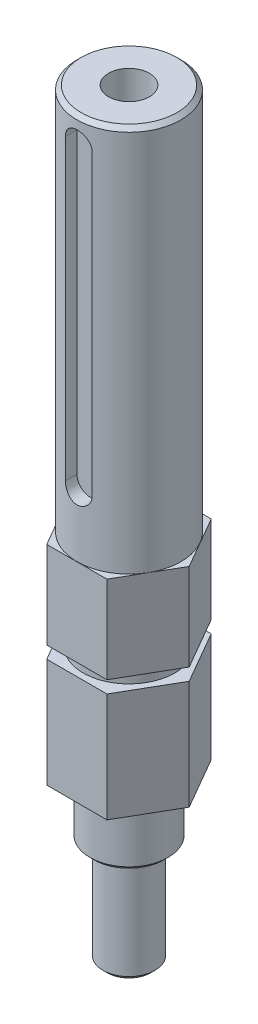
ISO-10303-21;
HEADER;
FILE_DESCRIPTION(('STEP AP214'),'2;1');
FILE_NAME('part.step','',(''),(''),'','','');
FILE_SCHEMA(('AUTOMOTIVE_DESIGN { 1 0 10303 214 1 1 1 1 }'));
ENDSEC;
DATA;
#1=APPLICATION_CONTEXT('core data for automotive mechanical design processes');
#2=APPLICATION_PROTOCOL_DEFINITION('international standard','automotive_design',2000,#1);
#3=PRODUCT_CONTEXT('',#1,'mechanical');
#4=PRODUCT('Part','Part','',(#3));
#5=PRODUCT_RELATED_PRODUCT_CATEGORY('part','',(#4));
#6=PRODUCT_DEFINITION_FORMATION('','',#4);
#7=PRODUCT_DEFINITION_CONTEXT('part definition',#1,'design');
#8=PRODUCT_DEFINITION('design','',#6,#7);
#9=PRODUCT_DEFINITION_SHAPE('','',#8);
#10=(LENGTH_UNIT() NAMED_UNIT(*) SI_UNIT(.MILLI.,.METRE.));
#11=(NAMED_UNIT(*) PLANE_ANGLE_UNIT() SI_UNIT($,.RADIAN.));
#12=(NAMED_UNIT(*) SI_UNIT($,.STERADIAN.) SOLID_ANGLE_UNIT());
#13=UNCERTAINTY_MEASURE_WITH_UNIT(LENGTH_MEASURE(1.E-05),#10,'distance_accuracy_value','');
#14=(GEOMETRIC_REPRESENTATION_CONTEXT(3) GLOBAL_UNCERTAINTY_ASSIGNED_CONTEXT((#13)) GLOBAL_UNIT_ASSIGNED_CONTEXT((#10,
#11,#12)) REPRESENTATION_CONTEXT('',''));
#15=CARTESIAN_POINT('',(0.,0.,0.));
#16=DIRECTION('',(0.,0.,1.));
#17=DIRECTION('',(1.,0.,0.));
#18=AXIS2_PLACEMENT_3D('',#15,#16,#17);
#19=CARTESIAN_POINT('',(-35.1448337161431,-45.212,-16.669011646302));
#20=DIRECTION('',(0.,-1.,0.));
#21=DIRECTION('',(0.,0.,-1.));
#22=AXIS2_PLACEMENT_3D('',#19,#20,#21);
#23=PLANE('',#22);
#24=CARTESIAN_POINT('',(-38.3071337161431,-45.2119999999923,-16.669011646302));
#25=DIRECTION('',(0.,1.,0.));
#26=DIRECTION('',(0.,0.,1.));
#27=AXIS2_PLACEMENT_3D('',#24,#25,#26);
#28=CIRCLE('',#27,2.65430000003345);
#29=CARTESIAN_POINT('',(-38.3071337161431,-45.2119999999923,-14.0147116462686));
#30=VERTEX_POINT('',#29);
#31=EDGE_CURVE('E20',#30,#30,#28,.T.);
#32=ORIENTED_EDGE('',*,*,#31,.F.);
#33=EDGE_LOOP('',(#32));
#34=FACE_BOUND('',#33,.T.);
#35=ADVANCED_FACE('F17',(#34),#23,.T.);
#36=CARTESIAN_POINT('',(-38.3071337161431,-44.704000000138,-16.669011646302));
#37=DIRECTION('',(0.,1.,0.));
#38=DIRECTION('',(0.,0.,1.));
#39=AXIS2_PLACEMENT_3D('',#36,#37,#38);
#40=CONICAL_SURFACE('',#39,3.16229999994458,0.785398163453397);
#41=ORIENTED_EDGE('',*,*,#31,.T.);
#42=EDGE_LOOP('',(#41));
#43=FACE_BOUND('',#42,.T.);
#44=CARTESIAN_POINT('',(-38.3071337161431,-44.704,-16.669011646302));
#45=DIRECTION('',(0.,1.,0.));
#46=DIRECTION('',(0.,0.,1.));
#47=AXIS2_PLACEMENT_3D('',#44,#45,#46);
#48=CIRCLE('',#47,3.1623);
#49=CARTESIAN_POINT('',(-38.3071337161431,-44.704,-13.506711646302));
#50=VERTEX_POINT('',#49);
#51=EDGE_CURVE('E176',#50,#50,#48,.T.);
#52=ORIENTED_EDGE('',*,*,#51,.F.);
#53=EDGE_LOOP('',(#52));
#54=FACE_BOUND('',#53,.T.);
#55=ADVANCED_FACE('F374',(#43,#54),#40,.T.);
#56=CARTESIAN_POINT('',(-38.3071337161431,-45.212,-16.669011646302));
#57=DIRECTION('',(0.,1.,0.));
#58=DIRECTION('',(0.,0.,1.));
#59=AXIS2_PLACEMENT_3D('',#56,#57,#58);
#60=CYLINDRICAL_SURFACE('',#59,3.1623);
#61=ORIENTED_EDGE('',*,*,#51,.T.);
#62=EDGE_LOOP('',(#61));
#63=FACE_BOUND('',#62,.T.);
#64=CARTESIAN_POINT('',(-38.3071337161431,-32.512,-16.669011646302));
#65=DIRECTION('',(0.,1.,0.));
#66=DIRECTION('',(0.,0.,1.));
#67=AXIS2_PLACEMENT_3D('',#64,#65,#66);
#68=CIRCLE('',#67,3.1623);
#69=CARTESIAN_POINT('',(-38.3071337161431,-32.512,-13.506711646302));
#70=VERTEX_POINT('',#69);
#71=EDGE_CURVE('E178',#70,#70,#68,.T.);
#72=ORIENTED_EDGE('',*,*,#71,.F.);
#73=EDGE_LOOP('',(#72));
#74=FACE_BOUND('',#73,.T.);
#75=ADVANCED_FACE('F371',(#63,#74),#60,.T.);
#76=CARTESIAN_POINT('',(-33.5573337161431,-32.512,-16.669011646302));
#77=DIRECTION('',(0.,-1.,0.));
#78=DIRECTION('',(0.,0.,-1.));
#79=AXIS2_PLACEMENT_3D('',#76,#77,#78);
#80=PLANE('',#79);
#81=ORIENTED_EDGE('',*,*,#71,.T.);
#82=EDGE_LOOP('',(#81));
#83=FACE_BOUND('',#82,.T.);
#84=CARTESIAN_POINT('',(-38.3071337161431,-32.5119999999401,-16.669011646302));
#85=DIRECTION('',(0.,1.,0.));
#86=DIRECTION('',(0.,0.,1.));
#87=AXIS2_PLACEMENT_3D('',#84,#85,#86);
#88=CIRCLE('',#87,4.24180000006128);
#89=CARTESIAN_POINT('',(-38.3071337161431,-32.5119999999401,-12.4272116462407));
#90=VERTEX_POINT('',#89);
#91=EDGE_CURVE('E175',#90,#90,#88,.T.);
#92=ORIENTED_EDGE('',*,*,#91,.F.);
#93=EDGE_LOOP('',(#92));
#94=FACE_BOUND('',#93,.T.);
#95=ADVANCED_FACE('F367',(#83,#94),#80,.T.);
#96=CARTESIAN_POINT('',(-38.3071337161431,-32.0040000000859,-16.669011646302));
#97=DIRECTION('',(0.,1.,0.));
#98=DIRECTION('',(0.,0.,1.));
#99=AXIS2_PLACEMENT_3D('',#96,#97,#98);
#100=CONICAL_SURFACE('',#99,4.74979999991557,0.785398163397448);
#101=CARTESIAN_POINT('',(-38.3071337161431,-32.004,-16.669011646302));
#102=DIRECTION('',(0.,1.,0.));
#103=DIRECTION('',(0.,0.,1.));
#104=AXIS2_PLACEMENT_3D('',#101,#102,#103);
#105=CIRCLE('',#104,4.7498);
#106=CARTESIAN_POINT('',(-38.3071337161431,-32.004,-11.919211646302));
#107=VERTEX_POINT('',#106);
#108=EDGE_CURVE('E172',#107,#107,#105,.T.);
#109=ORIENTED_EDGE('',*,*,#108,.F.);
#110=EDGE_LOOP('',(#109));
#111=FACE_BOUND('',#110,.T.);
#112=ORIENTED_EDGE('',*,*,#91,.T.);
#113=EDGE_LOOP('',(#112));
#114=FACE_BOUND('',#113,.T.);
#115=ADVANCED_FACE('F363',(#111,#114),#100,.T.);
#116=CARTESIAN_POINT('',(-38.3071337161431,-45.212,-16.669011646302));
#117=DIRECTION('',(0.,1.,0.));
#118=DIRECTION('',(0.,0.,1.));
#119=AXIS2_PLACEMENT_3D('',#116,#117,#118);
#120=CYLINDRICAL_SURFACE('',#119,4.7498);
#121=CARTESIAN_POINT('',(-38.3071337161431,-25.4,-16.669011646302));
#122=DIRECTION('',(0.,1.,0.));
#123=DIRECTION('',(0.,0.,1.));
#124=AXIS2_PLACEMENT_3D('',#121,#122,#123);
#125=CIRCLE('',#124,4.7498);
#126=CARTESIAN_POINT('',(-38.3071337161431,-25.4,-11.919211646302));
#127=VERTEX_POINT('',#126);
#128=EDGE_CURVE('E154',#127,#127,#125,.T.);
#129=ORIENTED_EDGE('',*,*,#128,.F.);
#130=EDGE_LOOP('',(#129));
#131=FACE_BOUND('',#130,.T.);
#132=ORIENTED_EDGE('',*,*,#108,.T.);
#133=EDGE_LOOP('',(#132));
#134=FACE_BOUND('',#133,.T.);
#135=ADVANCED_FACE('F360',(#131,#134),#120,.T.);
#136=CARTESIAN_POINT('',(-41.9733079254973,-25.4,-10.319011646302));
#137=DIRECTION('',(0.,-1.,0.));
#138=DIRECTION('',(0.,0.,-1.));
#139=AXIS2_PLACEMENT_3D('',#136,#137,#138);
#140=PLANE('',#139);
#141=DIRECTION('',(-0.5,0.,-0.866025403784439));
#142=VECTOR('',#141,1.);
#143=CARTESIAN_POINT('',(-34.640959506789,-25.4,-23.019011646302));
#144=LINE('',#143,#142);
#145=CARTESIAN_POINT('',(-30.9747852974349,-25.4,-16.669011646302));
#146=VERTEX_POINT('',#145);
#147=CARTESIAN_POINT('',(-34.640959506789,-25.4,-23.019011646302));
#148=VERTEX_POINT('',#147);
#149=EDGE_CURVE('E313',#146,#148,#144,.T.);
#150=ORIENTED_EDGE('',*,*,#149,.F.);
#151=DIRECTION('',(0.500000000000001,0.,-0.866025403784438));
#152=VECTOR('',#151,1.);
#153=CARTESIAN_POINT('',(-30.9747852974349,-25.4,-16.669011646302));
#154=LINE('',#153,#152);
#155=CARTESIAN_POINT('',(-34.640959506789,-25.4,-10.319011646302));
#156=VERTEX_POINT('',#155);
#157=EDGE_CURVE('E307',#156,#146,#154,.T.);
#158=ORIENTED_EDGE('',*,*,#157,.F.);
#159=DIRECTION('',(1.,0.,0.));
#160=VECTOR('',#159,1.);
#161=CARTESIAN_POINT('',(-34.640959506789,-25.4,-10.319011646302));
#162=LINE('',#161,#160);
#163=CARTESIAN_POINT('',(-41.9733079254973,-25.4,-10.319011646302));
#164=VERTEX_POINT('',#163);
#165=EDGE_CURVE('E151',#164,#156,#162,.T.);
#166=ORIENTED_EDGE('',*,*,#165,.F.);
#167=DIRECTION('',(0.5,0.,0.866025403784439));
#168=VECTOR('',#167,1.);
#169=CARTESIAN_POINT('',(-41.9733079254973,-25.4,-10.319011646302));
#170=LINE('',#169,#168);
#171=CARTESIAN_POINT('',(-45.6394821348514,-25.4,-16.669011646302));
#172=VERTEX_POINT('',#171);
#173=EDGE_CURVE('E146',#172,#164,#170,.T.);
#174=ORIENTED_EDGE('',*,*,#173,.F.);
#175=DIRECTION('',(-0.5,0.,0.866025403784439));
#176=VECTOR('',#175,1.);
#177=CARTESIAN_POINT('',(-45.6394821348514,-25.4,-16.669011646302));
#178=LINE('',#177,#176);
#179=CARTESIAN_POINT('',(-41.9733079254973,-25.4,-23.019011646302));
#180=VERTEX_POINT('',#179);
#181=EDGE_CURVE('E143',#180,#172,#178,.T.);
#182=ORIENTED_EDGE('',*,*,#181,.F.);
#183=DIRECTION('',(-1.,0.,0.));
#184=VECTOR('',#183,1.);
#185=CARTESIAN_POINT('',(-41.9733079254973,-25.4,-23.019011646302));
#186=LINE('',#185,#184);
#187=EDGE_CURVE('E163',#148,#180,#186,.T.);
#188=ORIENTED_EDGE('',*,*,#187,.F.);
#189=EDGE_LOOP('',(#150,#158,#166,#174,#182,#188));
#190=FACE_BOUND('',#189,.T.);
#191=ORIENTED_EDGE('',*,*,#128,.T.);
#192=EDGE_LOOP('',(#191));
#193=FACE_BOUND('',#192,.T.);
#194=ADVANCED_FACE('F148',(#190,#193),#140,.T.);
#195=CARTESIAN_POINT('',(-41.9733079254973,-12.1158,-10.319011646302));
#196=DIRECTION('',(-0.866025403784439,0.,0.5));
#197=DIRECTION('',(0.5,0.,0.866025403784439));
#198=AXIS2_PLACEMENT_3D('',#195,#196,#197);
#199=PLANE('',#198);
#200=DIRECTION('',(-0.5,0.,-0.866025403784438));
#201=VECTOR('',#200,1.);
#202=CARTESIAN_POINT('',(-41.9733079254973,-12.1158,-10.319011646302));
#203=LINE('',#202,#201);
#204=CARTESIAN_POINT('',(-41.9733079254973,-12.1158,-10.319011646302));
#205=VERTEX_POINT('',#204);
#206=CARTESIAN_POINT('',(-45.6394821348514,-12.1158,-16.669011646302));
#207=VERTEX_POINT('',#206);
#208=EDGE_CURVE('E160',#205,#207,#203,.T.);
#209=ORIENTED_EDGE('',*,*,#208,.T.);
#210=DIRECTION('',(0.,1.,0.));
#211=VECTOR('',#210,1.);
#212=CARTESIAN_POINT('',(-45.6394821348514,-12.1158,-16.669011646302));
#213=LINE('',#212,#211);
#214=EDGE_CURVE('E157',#172,#207,#213,.T.);
#215=ORIENTED_EDGE('',*,*,#214,.F.);
#216=ORIENTED_EDGE('',*,*,#173,.T.);
#217=DIRECTION('',(0.,1.,0.));
#218=VECTOR('',#217,1.);
#219=CARTESIAN_POINT('',(-41.9733079254973,-12.1158,-10.319011646302));
#220=LINE('',#219,#218);
#221=EDGE_CURVE('E298',#205,#164,#220,.F.);
#222=ORIENTED_EDGE('',*,*,#221,.F.);
#223=EDGE_LOOP('',(#209,#215,#216,#222));
#224=FACE_BOUND('',#223,.T.);
#225=ADVANCED_FACE('F158',(#224),#199,.T.);
#226=CARTESIAN_POINT('',(-45.6394821348514,-12.1158,-16.669011646302));
#227=DIRECTION('',(-0.866025403784439,0.,-0.5));
#228=DIRECTION('',(-0.5,0.,0.866025403784439));
#229=AXIS2_PLACEMENT_3D('',#226,#227,#228);
#230=PLANE('',#229);
#231=DIRECTION('',(0.5,0.,-0.866025403784438));
#232=VECTOR('',#231,1.);
#233=CARTESIAN_POINT('',(-45.6394821348514,-12.1158,-16.669011646302));
#234=LINE('',#233,#232);
#235=CARTESIAN_POINT('',(-41.9733079254973,-12.1158,-23.019011646302));
#236=VERTEX_POINT('',#235);
#237=EDGE_CURVE('E295',#207,#236,#234,.T.);
#238=ORIENTED_EDGE('',*,*,#237,.T.);
#239=DIRECTION('',(0.,1.,0.));
#240=VECTOR('',#239,1.);
#241=CARTESIAN_POINT('',(-41.9733079254973,-12.1158,-23.019011646302));
#242=LINE('',#241,#240);
#243=EDGE_CURVE('E167',#180,#236,#242,.T.);
#244=ORIENTED_EDGE('',*,*,#243,.F.);
#245=ORIENTED_EDGE('',*,*,#181,.T.);
#246=ORIENTED_EDGE('',*,*,#214,.T.);
#247=EDGE_LOOP('',(#238,#244,#245,#246));
#248=FACE_BOUND('',#247,.T.);
#249=ADVANCED_FACE('F165',(#248),#230,.T.);
#250=CARTESIAN_POINT('',(-41.9733079254973,-12.1158,-23.019011646302));
#251=DIRECTION('',(0.,0.,-1.));
#252=DIRECTION('',(-1.,0.,0.));
#253=AXIS2_PLACEMENT_3D('',#250,#251,#252);
#254=PLANE('',#253);
#255=DIRECTION('',(1.,0.,0.));
#256=VECTOR('',#255,1.);
#257=CARTESIAN_POINT('',(-41.9733079254973,-12.1158,-23.019011646302));
#258=LINE('',#257,#256);
#259=CARTESIAN_POINT('',(-34.640959506789,-12.1158,-23.019011646302));
#260=VERTEX_POINT('',#259);
#261=EDGE_CURVE('E293',#236,#260,#258,.T.);
#262=ORIENTED_EDGE('',*,*,#261,.T.);
#263=DIRECTION('',(0.,1.,0.));
#264=VECTOR('',#263,1.);
#265=CARTESIAN_POINT('',(-34.640959506789,-12.1158,-23.019011646302));
#266=LINE('',#265,#264);
#267=EDGE_CURVE('E310',#148,#260,#266,.T.);
#268=ORIENTED_EDGE('',*,*,#267,.F.);
#269=ORIENTED_EDGE('',*,*,#187,.T.);
#270=ORIENTED_EDGE('',*,*,#243,.T.);
#271=EDGE_LOOP('',(#262,#268,#269,#270));
#272=FACE_BOUND('',#271,.T.);
#273=ADVANCED_FACE('F318',(#272),#254,.T.);
#274=CARTESIAN_POINT('',(-34.640959506789,-12.1158,-23.019011646302));
#275=DIRECTION('',(0.866025403784439,0.,-0.5));
#276=DIRECTION('',(-0.5,0.,-0.866025403784439));
#277=AXIS2_PLACEMENT_3D('',#274,#275,#276);
#278=PLANE('',#277);
#279=DIRECTION('',(0.5,0.,0.866025403784438));
#280=VECTOR('',#279,1.);
#281=CARTESIAN_POINT('',(-34.640959506789,-12.1158,-23.019011646302));
#282=LINE('',#281,#280);
#283=CARTESIAN_POINT('',(-30.9747852974349,-12.1158,-16.669011646302));
#284=VERTEX_POINT('',#283);
#285=EDGE_CURVE('E291',#260,#284,#282,.T.);
#286=ORIENTED_EDGE('',*,*,#285,.T.);
#287=DIRECTION('',(0.,1.,0.));
#288=VECTOR('',#287,1.);
#289=CARTESIAN_POINT('',(-30.9747852974349,-12.1158,-16.669011646302));
#290=LINE('',#289,#288);
#291=EDGE_CURVE('E304',#146,#284,#290,.T.);
#292=ORIENTED_EDGE('',*,*,#291,.F.);
#293=ORIENTED_EDGE('',*,*,#149,.T.);
#294=ORIENTED_EDGE('',*,*,#267,.T.);
#295=EDGE_LOOP('',(#286,#292,#293,#294));
#296=FACE_BOUND('',#295,.T.);
#297=ADVANCED_FACE('F323',(#296),#278,.T.);
#298=CARTESIAN_POINT('',(-30.9747852974349,-12.1158,-16.669011646302));
#299=DIRECTION('',(0.866025403784438,0.,0.500000000000001));
#300=DIRECTION('',(0.500000000000001,0.,-0.866025403784438));
#301=AXIS2_PLACEMENT_3D('',#298,#299,#300);
#302=PLANE('',#301);
#303=DIRECTION('',(-0.500000000000001,0.,0.866025403784438));
#304=VECTOR('',#303,1.);
#305=CARTESIAN_POINT('',(-30.9747852974349,-12.1158,-16.669011646302));
#306=LINE('',#305,#304);
#307=CARTESIAN_POINT('',(-34.640959506789,-12.1158,-10.319011646302));
#308=VERTEX_POINT('',#307);
#309=EDGE_CURVE('E289',#284,#308,#306,.T.);
#310=ORIENTED_EDGE('',*,*,#309,.T.);
#311=DIRECTION('',(0.,1.,0.));
#312=VECTOR('',#311,1.);
#313=CARTESIAN_POINT('',(-34.640959506789,-12.1158,-10.319011646302));
#314=LINE('',#313,#312);
#315=EDGE_CURVE('E300',#156,#308,#314,.T.);
#316=ORIENTED_EDGE('',*,*,#315,.F.);
#317=ORIENTED_EDGE('',*,*,#157,.T.);
#318=ORIENTED_EDGE('',*,*,#291,.T.);
#319=EDGE_LOOP('',(#310,#316,#317,#318));
#320=FACE_BOUND('',#319,.T.);
#321=ADVANCED_FACE('F327',(#320),#302,.T.);
#322=CARTESIAN_POINT('',(-34.640959506789,-12.1158,-10.319011646302));
#323=DIRECTION('',(0.,0.,1.));
#324=DIRECTION('',(1.,0.,0.));
#325=AXIS2_PLACEMENT_3D('',#322,#323,#324);
#326=PLANE('',#325);
#327=DIRECTION('',(1.,0.,0.));
#328=VECTOR('',#327,1.);
#329=CARTESIAN_POINT('',(-41.9733079254973,-12.1158,-10.319011646302));
#330=LINE('',#329,#328);
#331=EDGE_CURVE('E286',#308,#205,#330,.F.);
#332=ORIENTED_EDGE('',*,*,#331,.T.);
#333=ORIENTED_EDGE('',*,*,#221,.T.);
#334=ORIENTED_EDGE('',*,*,#165,.T.);
#335=ORIENTED_EDGE('',*,*,#315,.T.);
#336=EDGE_LOOP('',(#332,#333,#334,#335));
#337=FACE_BOUND('',#336,.T.);
#338=ADVANCED_FACE('F330',(#337),#326,.T.);
#339=CARTESIAN_POINT('',(-41.9733079254973,-12.1158,-10.319011646302));
#340=DIRECTION('',(0.,-1.,0.));
#341=DIRECTION('',(0.,0.,-1.));
#342=AXIS2_PLACEMENT_3D('',#339,#340,#341);
#343=PLANE('',#342);
#344=CARTESIAN_POINT('',(-38.3071337161431,-12.1158,-16.669011646302));
#345=DIRECTION('',(0.,-1.,0.));
#346=DIRECTION('',(0.,0.,-1.));
#347=AXIS2_PLACEMENT_3D('',#344,#345,#346);
#348=CIRCLE('',#347,5.58800000000003);
#349=CARTESIAN_POINT('',(-38.3071337161431,-12.1158,-22.257011646302));
#350=VERTEX_POINT('',#349);
#351=EDGE_CURVE('E285',#350,#350,#348,.F.);
#352=ORIENTED_EDGE('',*,*,#351,.F.);
#353=EDGE_LOOP('',(#352));
#354=FACE_BOUND('',#353,.T.);
#355=ORIENTED_EDGE('',*,*,#309,.F.);
#356=ORIENTED_EDGE('',*,*,#285,.F.);
#357=ORIENTED_EDGE('',*,*,#261,.F.);
#358=ORIENTED_EDGE('',*,*,#237,.F.);
#359=ORIENTED_EDGE('',*,*,#208,.F.);
#360=ORIENTED_EDGE('',*,*,#331,.F.);
#361=EDGE_LOOP('',(#355,#356,#357,#358,#359,#360));
#362=FACE_BOUND('',#361,.T.);
#363=ADVANCED_FACE('F332',(#354,#362),#343,.F.);
#364=CARTESIAN_POINT('',(-38.3071337161431,31.2419999999999,-16.669011646302));
#365=DIRECTION('',(0.,1.,0.));
#366=DIRECTION('',(0.,0.,1.));
#367=AXIS2_PLACEMENT_3D('',#364,#365,#366);
#368=CONICAL_SURFACE('',#367,2.48793000000006,1.0297442586766);
#369=CARTESIAN_POINT('',(-38.3071337161431,29.7471008401027,-16.6690116463016));
#370=VERTEX_POINT('',#369);
#371=VERTEX_LOOP('',#370);
#372=FACE_BOUND('',#371,.T.);
#373=CARTESIAN_POINT('',(-38.3071337161431,31.242,-16.669011646302));
#374=DIRECTION('',(0.,-1.,0.));
#375=DIRECTION('',(0.,0.,-1.));
#376=AXIS2_PLACEMENT_3D('',#373,#374,#375);
#377=CIRCLE('',#376,2.48793);
#378=CARTESIAN_POINT('',(-38.3071337161431,31.242,-19.156941646302));
#379=VERTEX_POINT('',#378);
#380=EDGE_CURVE('E281',#379,#379,#377,.F.);
#381=ORIENTED_EDGE('',*,*,#380,.T.);
#382=EDGE_LOOP('',(#381));
#383=FACE_BOUND('',#382,.T.);
#384=ADVANCED_FACE('F334',(#372,#383),#368,.F.);
#385=CARTESIAN_POINT('',(-38.3071337161431,-10.6172,-16.669011646302));
#386=DIRECTION('',(0.,-1.,0.));
#387=DIRECTION('',(0.,0.,-1.));
#388=AXIS2_PLACEMENT_3D('',#385,#386,#387);
#389=CYLINDRICAL_SURFACE('',#388,5.58800000000003);
#390=ORIENTED_EDGE('',*,*,#351,.T.);
#391=EDGE_LOOP('',(#390));
#392=FACE_BOUND('',#391,.T.);
#393=CARTESIAN_POINT('',(-38.3071337161431,-10.6172,-16.669011646302));
#394=DIRECTION('',(0.,-1.,0.));
#395=DIRECTION('',(0.,0.,-1.));
#396=AXIS2_PLACEMENT_3D('',#393,#394,#395);
#397=CIRCLE('',#396,5.58800000000003);
#398=CARTESIAN_POINT('',(-38.3071337161431,-10.6172,-22.257011646302));
#399=VERTEX_POINT('',#398);
#400=EDGE_CURVE('E284',#399,#399,#397,.F.);
#401=ORIENTED_EDGE('',*,*,#400,.F.);
#402=EDGE_LOOP('',(#401));
#403=FACE_BOUND('',#402,.T.);
#404=ADVANCED_FACE('F341',(#392,#403),#389,.T.);
#405=CARTESIAN_POINT('',(-38.3071337161431,47.117,-16.669011646302));
#406=DIRECTION('',(0.,-1.,0.));
#407=DIRECTION('',(0.,0.,-1.));
#408=AXIS2_PLACEMENT_3D('',#405,#406,#407);
#409=CYLINDRICAL_SURFACE('',#408,2.48793);
#410=ORIENTED_EDGE('',*,*,#380,.F.);
#411=EDGE_LOOP('',(#410));
#412=FACE_BOUND('',#411,.T.);
#413=CARTESIAN_POINT('',(-38.3071337161431,47.117,-16.669011646302));
#414=DIRECTION('',(0.,-1.,0.));
#415=DIRECTION('',(0.,0.,-1.));
#416=AXIS2_PLACEMENT_3D('',#413,#414,#415);
#417=CIRCLE('',#416,2.48793);
#418=CARTESIAN_POINT('',(-38.3071337161431,47.117,-19.156941646302));
#419=VERTEX_POINT('',#418);
#420=EDGE_CURVE('E280',#419,#419,#417,.T.);
#421=ORIENTED_EDGE('',*,*,#420,.F.);
#422=EDGE_LOOP('',(#421));
#423=FACE_BOUND('',#422,.T.);
#424=ADVANCED_FACE('F460',(#412,#423),#409,.F.);
#425=CARTESIAN_POINT('',(-41.9733079254973,-10.6172,-10.319011646302));
#426=DIRECTION('',(0.,-1.,0.));
#427=DIRECTION('',(0.,0.,-1.));
#428=AXIS2_PLACEMENT_3D('',#425,#426,#427);
#429=PLANE('',#428);
#430=ORIENTED_EDGE('',*,*,#400,.T.);
#431=EDGE_LOOP('',(#430));
#432=FACE_BOUND('',#431,.T.);
#433=DIRECTION('',(-0.5,0.,-0.866025403784438));
#434=VECTOR('',#433,1.);
#435=CARTESIAN_POINT('',(-34.640959506789,-10.6172,-23.019011646302));
#436=LINE('',#435,#434);
#437=CARTESIAN_POINT('',(-30.9747852974349,-10.6172,-16.669011646302));
#438=VERTEX_POINT('',#437);
#439=CARTESIAN_POINT('',(-34.640959506789,-10.6172,-23.019011646302));
#440=VERTEX_POINT('',#439);
#441=EDGE_CURVE('E262',#438,#440,#436,.T.);
#442=ORIENTED_EDGE('',*,*,#441,.F.);
#443=DIRECTION('',(0.500000000000001,0.,-0.866025403784438));
#444=VECTOR('',#443,1.);
#445=CARTESIAN_POINT('',(-30.9747852974349,-10.6172,-16.669011646302));
#446=LINE('',#445,#444);
#447=CARTESIAN_POINT('',(-34.640959506789,-10.6172,-10.319011646302));
#448=VERTEX_POINT('',#447);
#449=EDGE_CURVE('E256',#448,#438,#446,.T.);
#450=ORIENTED_EDGE('',*,*,#449,.F.);
#451=DIRECTION('',(1.,0.,0.));
#452=VECTOR('',#451,1.);
#453=CARTESIAN_POINT('',(-34.640959506789,-10.6172,-10.319011646302));
#454=LINE('',#453,#452);
#455=CARTESIAN_POINT('',(-41.9733079254973,-10.6172,-10.319011646302));
#456=VERTEX_POINT('',#455);
#457=EDGE_CURVE('E251',#456,#448,#454,.T.);
#458=ORIENTED_EDGE('',*,*,#457,.F.);
#459=DIRECTION('',(0.5,0.,0.866025403784439));
#460=VECTOR('',#459,1.);
#461=CARTESIAN_POINT('',(-41.9733079254973,-10.6172,-10.319011646302));
#462=LINE('',#461,#460);
#463=CARTESIAN_POINT('',(-45.6394821348514,-10.6172,-16.669011646302));
#464=VERTEX_POINT('',#463);
#465=EDGE_CURVE('E277',#464,#456,#462,.T.);
#466=ORIENTED_EDGE('',*,*,#465,.F.);
#467=DIRECTION('',(-0.5,0.,0.866025403784438));
#468=VECTOR('',#467,1.);
#469=CARTESIAN_POINT('',(-45.6394821348514,-10.6172,-16.669011646302));
#470=LINE('',#469,#468);
#471=CARTESIAN_POINT('',(-41.9733079254973,-10.6172,-23.019011646302));
#472=VERTEX_POINT('',#471);
#473=EDGE_CURVE('E274',#472,#464,#470,.T.);
#474=ORIENTED_EDGE('',*,*,#473,.F.);
#475=DIRECTION('',(-1.,0.,0.));
#476=VECTOR('',#475,1.);
#477=CARTESIAN_POINT('',(-41.9733079254973,-10.6172,-23.019011646302));
#478=LINE('',#477,#476);
#479=EDGE_CURVE('E268',#440,#472,#478,.T.);
#480=ORIENTED_EDGE('',*,*,#479,.F.);
#481=EDGE_LOOP('',(#442,#450,#458,#466,#474,#480));
#482=FACE_BOUND('',#481,.T.);
#483=ADVANCED_FACE('F456',(#432,#482),#429,.T.);
#484=CARTESIAN_POINT('',(-38.3071337161431,47.117,-16.669011646302));
#485=DIRECTION('',(0.,1.,0.));
#486=DIRECTION('',(0.,0.,1.));
#487=AXIS2_PLACEMENT_3D('',#484,#485,#486);
#488=PLANE('',#487);
#489=ORIENTED_EDGE('',*,*,#420,.T.);
#490=EDGE_LOOP('',(#489));
#491=FACE_BOUND('',#490,.T.);
#492=CARTESIAN_POINT('',(-38.3071337161431,47.1170000000143,-16.669011646302));
#493=DIRECTION('',(0.,-1.,0.));
#494=DIRECTION('',(0.,0.,-1.));
#495=AXIS2_PLACEMENT_3D('',#492,#493,#494);
#496=CIRCLE('',#495,5.82929999994338);
#497=CARTESIAN_POINT('',(-38.3071337161431,47.1170000000143,-22.4983116462454));
#498=VERTEX_POINT('',#497);
#499=EDGE_CURVE('E238',#498,#498,#496,.T.);
#500=ORIENTED_EDGE('',*,*,#499,.F.);
#501=EDGE_LOOP('',(#500));
#502=FACE_BOUND('',#501,.T.);
#503=ADVANCED_FACE('F452',(#491,#502),#488,.T.);
#504=CARTESIAN_POINT('',(-41.9733079254973,0.,-10.319011646302));
#505=DIRECTION('',(-0.866025403784439,0.,0.5));
#506=DIRECTION('',(0.5,0.,0.866025403784439));
#507=AXIS2_PLACEMENT_3D('',#504,#505,#506);
#508=PLANE('',#507);
#509=DIRECTION('',(-0.5,0.,-0.866025403784438));
#510=VECTOR('',#509,1.);
#511=CARTESIAN_POINT('',(-41.9733079254973,0.,-10.319011646302));
#512=LINE('',#511,#510);
#513=CARTESIAN_POINT('',(-41.9733079254973,0.,-10.319011646302));
#514=VERTEX_POINT('',#513);
#515=CARTESIAN_POINT('',(-45.6394821348514,0.,-16.669011646302));
#516=VERTEX_POINT('',#515);
#517=EDGE_CURVE('E236',#514,#516,#512,.T.);
#518=ORIENTED_EDGE('',*,*,#517,.T.);
#519=DIRECTION('',(0.,1.,0.));
#520=VECTOR('',#519,1.);
#521=CARTESIAN_POINT('',(-45.6394821348514,0.,-16.669011646302));
#522=LINE('',#521,#520);
#523=EDGE_CURVE('E271',#464,#516,#522,.T.);
#524=ORIENTED_EDGE('',*,*,#523,.F.);
#525=ORIENTED_EDGE('',*,*,#465,.T.);
#526=DIRECTION('',(0.,1.,0.));
#527=VECTOR('',#526,1.);
#528=CARTESIAN_POINT('',(-41.9733079254973,0.,-10.319011646302));
#529=LINE('',#528,#527);
#530=EDGE_CURVE('E246',#514,#456,#529,.F.);
#531=ORIENTED_EDGE('',*,*,#530,.F.);
#532=EDGE_LOOP('',(#518,#524,#525,#531));
#533=FACE_BOUND('',#532,.T.);
#534=ADVANCED_FACE('F448',(#533),#508,.T.);
#535=CARTESIAN_POINT('',(-45.6394821348514,0.,-16.669011646302));
#536=DIRECTION('',(-0.866025403784438,0.,-0.5));
#537=DIRECTION('',(-0.5,0.,0.866025403784438));
#538=AXIS2_PLACEMENT_3D('',#535,#536,#537);
#539=PLANE('',#538);
#540=DIRECTION('',(0.5,0.,-0.866025403784438));
#541=VECTOR('',#540,1.);
#542=CARTESIAN_POINT('',(-45.6394821348514,0.,-16.669011646302));
#543=LINE('',#542,#541);
#544=CARTESIAN_POINT('',(-41.9733079254973,0.,-23.019011646302));
#545=VERTEX_POINT('',#544);
#546=EDGE_CURVE('E234',#516,#545,#543,.T.);
#547=ORIENTED_EDGE('',*,*,#546,.T.);
#548=DIRECTION('',(0.,1.,0.));
#549=VECTOR('',#548,1.);
#550=CARTESIAN_POINT('',(-41.9733079254973,0.,-23.019011646302));
#551=LINE('',#550,#549);
#552=EDGE_CURVE('E265',#472,#545,#551,.T.);
#553=ORIENTED_EDGE('',*,*,#552,.F.);
#554=ORIENTED_EDGE('',*,*,#473,.T.);
#555=ORIENTED_EDGE('',*,*,#523,.T.);
#556=EDGE_LOOP('',(#547,#553,#554,#555));
#557=FACE_BOUND('',#556,.T.);
#558=ADVANCED_FACE('F444',(#557),#539,.T.);
#559=CARTESIAN_POINT('',(-41.9733079254973,0.,-23.019011646302));
#560=DIRECTION('',(0.,0.,-1.));
#561=DIRECTION('',(-1.,0.,0.));
#562=AXIS2_PLACEMENT_3D('',#559,#560,#561);
#563=PLANE('',#562);
#564=DIRECTION('',(1.,0.,0.));
#565=VECTOR('',#564,1.);
#566=CARTESIAN_POINT('',(-41.9733079254973,0.,-23.019011646302));
#567=LINE('',#566,#565);
#568=CARTESIAN_POINT('',(-34.640959506789,0.,-23.019011646302));
#569=VERTEX_POINT('',#568);
#570=EDGE_CURVE('E232',#545,#569,#567,.T.);
#571=ORIENTED_EDGE('',*,*,#570,.T.);
#572=DIRECTION('',(0.,1.,0.));
#573=VECTOR('',#572,1.);
#574=CARTESIAN_POINT('',(-34.640959506789,0.,-23.019011646302));
#575=LINE('',#574,#573);
#576=EDGE_CURVE('E259',#440,#569,#575,.T.);
#577=ORIENTED_EDGE('',*,*,#576,.F.);
#578=ORIENTED_EDGE('',*,*,#479,.T.);
#579=ORIENTED_EDGE('',*,*,#552,.T.);
#580=EDGE_LOOP('',(#571,#577,#578,#579));
#581=FACE_BOUND('',#580,.T.);
#582=ADVANCED_FACE('F440',(#581),#563,.T.);
#583=CARTESIAN_POINT('',(-34.640959506789,0.,-23.019011646302));
#584=DIRECTION('',(0.866025403784438,0.,-0.5));
#585=DIRECTION('',(-0.5,0.,-0.866025403784438));
#586=AXIS2_PLACEMENT_3D('',#583,#584,#585);
#587=PLANE('',#586);
#588=DIRECTION('',(0.5,0.,0.866025403784438));
#589=VECTOR('',#588,1.);
#590=CARTESIAN_POINT('',(-34.640959506789,0.,-23.019011646302));
#591=LINE('',#590,#589);
#592=CARTESIAN_POINT('',(-30.9747852974349,0.,-16.669011646302));
#593=VERTEX_POINT('',#592);
#594=EDGE_CURVE('E230',#569,#593,#591,.T.);
#595=ORIENTED_EDGE('',*,*,#594,.T.);
#596=DIRECTION('',(0.,1.,0.));
#597=VECTOR('',#596,1.);
#598=CARTESIAN_POINT('',(-30.9747852974349,0.,-16.669011646302));
#599=LINE('',#598,#597);
#600=EDGE_CURVE('E254',#438,#593,#599,.T.);
#601=ORIENTED_EDGE('',*,*,#600,.F.);
#602=ORIENTED_EDGE('',*,*,#441,.T.);
#603=ORIENTED_EDGE('',*,*,#576,.T.);
#604=EDGE_LOOP('',(#595,#601,#602,#603));
#605=FACE_BOUND('',#604,.T.);
#606=ADVANCED_FACE('F437',(#605),#587,.T.);
#607=CARTESIAN_POINT('',(-30.9747852974349,0.,-16.669011646302));
#608=DIRECTION('',(0.866025403784438,0.,0.500000000000001));
#609=DIRECTION('',(0.500000000000001,0.,-0.866025403784438));
#610=AXIS2_PLACEMENT_3D('',#607,#608,#609);
#611=PLANE('',#610);
#612=DIRECTION('',(-0.500000000000001,0.,0.866025403784438));
#613=VECTOR('',#612,1.);
#614=CARTESIAN_POINT('',(-30.9747852974349,0.,-16.669011646302));
#615=LINE('',#614,#613);
#616=CARTESIAN_POINT('',(-34.640959506789,0.,-10.319011646302));
#617=VERTEX_POINT('',#616);
#618=EDGE_CURVE('E71',#593,#617,#615,.T.);
#619=ORIENTED_EDGE('',*,*,#618,.T.);
#620=DIRECTION('',(0.,1.,0.));
#621=VECTOR('',#620,1.);
#622=CARTESIAN_POINT('',(-34.640959506789,0.,-10.319011646302));
#623=LINE('',#622,#621);
#624=EDGE_CURVE('E249',#448,#617,#623,.T.);
#625=ORIENTED_EDGE('',*,*,#624,.F.);
#626=ORIENTED_EDGE('',*,*,#449,.T.);
#627=ORIENTED_EDGE('',*,*,#600,.T.);
#628=EDGE_LOOP('',(#619,#625,#626,#627));
#629=FACE_BOUND('',#628,.T.);
#630=ADVANCED_FACE('F433',(#629),#611,.T.);
#631=CARTESIAN_POINT('',(-34.640959506789,0.,-10.319011646302));
#632=DIRECTION('',(0.,0.,1.));
#633=DIRECTION('',(1.,0.,0.));
#634=AXIS2_PLACEMENT_3D('',#631,#632,#633);
#635=PLANE('',#634);
#636=DIRECTION('',(1.,0.,0.));
#637=VECTOR('',#636,1.);
#638=CARTESIAN_POINT('',(-41.9733079254973,0.,-10.319011646302));
#639=LINE('',#638,#637);
#640=EDGE_CURVE('E226',#617,#514,#639,.F.);
#641=ORIENTED_EDGE('',*,*,#640,.T.);
#642=ORIENTED_EDGE('',*,*,#530,.T.);
#643=ORIENTED_EDGE('',*,*,#457,.T.);
#644=ORIENTED_EDGE('',*,*,#624,.T.);
#645=EDGE_LOOP('',(#641,#642,#643,#644));
#646=FACE_BOUND('',#645,.T.);
#647=ADVANCED_FACE('F430',(#646),#635,.T.);
#648=CARTESIAN_POINT('',(-36.6688337161431,43.942,-9.912611646302));
#649=DIRECTION('',(1.,0.,0.));
#650=DIRECTION('',(0.,0.,-1.));
#651=AXIS2_PLACEMENT_3D('',#648,#649,#650);
#652=PLANE('',#651);
#653=DIRECTION('',(0.,1.,0.));
#654=VECTOR('',#653,1.);
#655=CARTESIAN_POINT('',(-36.6688337161431,7.62,-11.944611646302));
#656=LINE('',#655,#654);
#657=CARTESIAN_POINT('',(-36.6688337161431,43.942,-11.944611646302));
#658=VERTEX_POINT('',#657);
#659=CARTESIAN_POINT('',(-36.6688337161431,7.62,-11.944611646302));
#660=VERTEX_POINT('',#659);
#661=EDGE_CURVE('E241',#658,#660,#656,.F.);
#662=ORIENTED_EDGE('',*,*,#661,.T.);
#663=DIRECTION('',(0.,0.,-1.));
#664=VECTOR('',#663,1.);
#665=CARTESIAN_POINT('',(-36.6688337161431,7.62,-9.912611646302));
#666=LINE('',#665,#664);
#667=CARTESIAN_POINT('',(-36.6688337161431,7.62,-10.5471373908145));
#668=VERTEX_POINT('',#667);
#669=EDGE_CURVE('E59',#668,#660,#666,.T.);
#670=ORIENTED_EDGE('',*,*,#669,.F.);
#671=DIRECTION('',(0.,-1.,0.));
#672=VECTOR('',#671,1.);
#673=CARTESIAN_POINT('',(-36.6688337161431,47.117,-10.5471373908145));
#674=LINE('',#673,#672);
#675=CARTESIAN_POINT('',(-36.6688337161431,43.942,-10.5471373908145));
#676=VERTEX_POINT('',#675);
#677=EDGE_CURVE('E223',#676,#668,#674,.T.);
#678=ORIENTED_EDGE('',*,*,#677,.F.);
#679=DIRECTION('',(0.,0.,-1.));
#680=VECTOR('',#679,1.);
#681=CARTESIAN_POINT('',(-36.6688337161431,43.942,-9.912611646302));
#682=LINE('',#681,#680);
#683=EDGE_CURVE('E243',#658,#676,#682,.F.);
#684=ORIENTED_EDGE('',*,*,#683,.F.);
#685=EDGE_LOOP('',(#662,#670,#678,#684));
#686=FACE_BOUND('',#685,.T.);
#687=ADVANCED_FACE('F410',(#686),#652,.F.);
#688=CARTESIAN_POINT('',(-38.2944337161431,7.62,-11.944611646302));
#689=DIRECTION('',(0.,0.,-1.));
#690=DIRECTION('',(-1.,0.,0.));
#691=AXIS2_PLACEMENT_3D('',#688,#689,#690);
#692=PLANE('',#691);
#693=ORIENTED_EDGE('',*,*,#661,.F.);
#694=CARTESIAN_POINT('',(-38.2944337161431,43.942,-11.944611646302));
#695=DIRECTION('',(0.,0.,-1.));
#696=DIRECTION('',(-1.,0.,0.));
#697=AXIS2_PLACEMENT_3D('',#694,#695,#696);
#698=CIRCLE('',#697,1.6256);
#699=CARTESIAN_POINT('',(-39.9200337161431,43.942,-11.944611646302));
#700=VERTEX_POINT('',#699);
#701=EDGE_CURVE('E219',#658,#700,#698,.F.);
#702=ORIENTED_EDGE('',*,*,#701,.T.);
#703=DIRECTION('',(0.,1.,0.));
#704=VECTOR('',#703,1.);
#705=CARTESIAN_POINT('',(-39.9200337161431,7.62,-11.944611646302));
#706=LINE('',#705,#704);
#707=CARTESIAN_POINT('',(-39.9200337161431,7.62,-11.944611646302));
#708=VERTEX_POINT('',#707);
#709=EDGE_CURVE('E222',#700,#708,#706,.F.);
#710=ORIENTED_EDGE('',*,*,#709,.T.);
#711=CARTESIAN_POINT('',(-38.2944337161431,7.62,-11.944611646302));
#712=DIRECTION('',(0.,0.,-1.));
#713=DIRECTION('',(-1.,0.,0.));
#714=AXIS2_PLACEMENT_3D('',#711,#712,#713);
#715=CIRCLE('',#714,1.6256);
#716=EDGE_CURVE('E225',#708,#660,#715,.F.);
#717=ORIENTED_EDGE('',*,*,#716,.T.);
#718=EDGE_LOOP('',(#693,#702,#710,#717));
#719=FACE_BOUND('',#718,.T.);
#720=ADVANCED_FACE('F407',(#719),#692,.F.);
#721=CARTESIAN_POINT('',(-38.3071337161431,46.60900000016,-16.669011646302));
#722=DIRECTION('',(0.,-1.,0.));
#723=DIRECTION('',(0.,0.,-1.));
#724=AXIS2_PLACEMENT_3D('',#721,#722,#723);
#725=CONICAL_SURFACE('',#724,6.33729999985452,0.785398163453397);
#726=ORIENTED_EDGE('',*,*,#499,.T.);
#727=EDGE_LOOP('',(#726));
#728=FACE_BOUND('',#727,.T.);
#729=CARTESIAN_POINT('',(-38.3071337161431,46.609,-16.669011646302));
#730=DIRECTION('',(0.,-1.,0.));
#731=DIRECTION('',(0.,0.,-1.));
#732=AXIS2_PLACEMENT_3D('',#729,#730,#731);
#733=CIRCLE('',#732,6.3373);
#734=CARTESIAN_POINT('',(-38.3071337161431,46.609,-23.006311646302));
#735=VERTEX_POINT('',#734);
#736=EDGE_CURVE('E207',#735,#735,#733,.T.);
#737=ORIENTED_EDGE('',*,*,#736,.F.);
#738=EDGE_LOOP('',(#737));
#739=FACE_BOUND('',#738,.T.);
#740=ADVANCED_FACE('F418',(#728,#739),#725,.T.);
#741=CARTESIAN_POINT('',(-41.9733079254973,0.,-10.319011646302));
#742=DIRECTION('',(0.,-1.,0.));
#743=DIRECTION('',(0.,0.,-1.));
#744=AXIS2_PLACEMENT_3D('',#741,#742,#743);
#745=PLANE('',#744);
#746=CARTESIAN_POINT('',(-38.3071337161431,0.,-16.669011646302));
#747=DIRECTION('',(0.,-1.,0.));
#748=DIRECTION('',(0.,0.,-1.));
#749=AXIS2_PLACEMENT_3D('',#746,#747,#748);
#750=CIRCLE('',#749,6.3373);
#751=CARTESIAN_POINT('',(-38.3071337161431,0.,-23.006311646302));
#752=VERTEX_POINT('',#751);
#753=EDGE_CURVE('E211',#752,#752,#750,.F.);
#754=ORIENTED_EDGE('',*,*,#753,.F.);
#755=EDGE_LOOP('',(#754));
#756=FACE_BOUND('',#755,.T.);
#757=ORIENTED_EDGE('',*,*,#618,.F.);
#758=ORIENTED_EDGE('',*,*,#594,.F.);
#759=ORIENTED_EDGE('',*,*,#570,.F.);
#760=ORIENTED_EDGE('',*,*,#546,.F.);
#761=ORIENTED_EDGE('',*,*,#517,.F.);
#762=ORIENTED_EDGE('',*,*,#640,.F.);
#763=EDGE_LOOP('',(#757,#758,#759,#760,#761,#762));
#764=FACE_BOUND('',#763,.T.);
#765=ADVANCED_FACE('F413',(#756,#764),#745,.F.);
#766=CARTESIAN_POINT('',(-38.2944337161431,7.62,-9.912611646302));
#767=DIRECTION('',(0.,0.,-1.));
#768=DIRECTION('',(-1.,0.,0.));
#769=AXIS2_PLACEMENT_3D('',#766,#767,#768);
#770=CYLINDRICAL_SURFACE('',#769,1.6256);
#771=ORIENTED_EDGE('',*,*,#716,.F.);
#772=DIRECTION('',(0.,0.,1.));
#773=VECTOR('',#772,1.);
#774=CARTESIAN_POINT('',(-39.9200337161431,7.62,-9.912611646302));
#775=LINE('',#774,#773);
#776=CARTESIAN_POINT('',(-39.9200337161431,7.62,-10.5403963965086));
#777=VERTEX_POINT('',#776);
#778=EDGE_CURVE('E220',#708,#777,#775,.T.);
#779=ORIENTED_EDGE('',*,*,#778,.T.);
#780=CARTESIAN_POINT('',(-36.6688337161431,7.62,-10.5471373908145));
#781=CARTESIAN_POINT('',(-36.6688331100919,7.57508677691815,-10.5471405183145));
#782=CARTESIAN_POINT('',(-36.6706962456225,7.53019586174405,-10.5466386387906));
#783=CARTESIAN_POINT('',(-36.6781230803211,7.44075078269767,-10.5446571794989));
#784=CARTESIAN_POINT('',(-36.6836861261015,7.39619656077163,-10.5431777723583));
#785=CARTESIAN_POINT('',(-36.7058421837572,7.26371368533304,-10.5373329336803));
#786=CARTESIAN_POINT('',(-36.7279024890841,7.17669706632391,-10.5315605075661));
#787=CARTESIAN_POINT('',(-36.785881735209,7.00776292931235,-10.5169351684095));
#788=CARTESIAN_POINT('',(-36.8217990614285,6.92584481853792,-10.5080826142661));
#789=CARTESIAN_POINT('',(-36.9064250905725,6.76915632643435,-10.4882941374185));
#790=CARTESIAN_POINT('',(-36.9551372025294,6.6943878573029,-10.4773576596889));
#791=CARTESIAN_POINT('',(-37.0651738444627,6.55241795199924,-10.454341582249));
#792=CARTESIAN_POINT('',(-37.1267414214421,6.48540806038206,-10.442242821439));
#793=CARTESIAN_POINT('',(-37.2602380480791,6.36252362126526,-10.4184140226325));
#794=CARTESIAN_POINT('',(-37.3321706419867,6.30665289837255,-10.4066841124404));
#795=CARTESIAN_POINT('',(-37.4857159602333,6.20682360606488,-10.3846861467531));
#796=CARTESIAN_POINT('',(-37.5674620858195,6.16306427332973,-10.3744437254023));
#797=CARTESIAN_POINT('',(-37.737405204164,6.09002342307483,-10.3567974044013));
#798=CARTESIAN_POINT('',(-37.8255948309847,6.06072566201359,-10.3493903221486));
#799=CARTESIAN_POINT('',(-37.9796470409605,6.02381117685167,-10.339853051397));
#800=CARTESIAN_POINT('',(-38.0445631591427,6.01237015309669,-10.336815344419));
#801=CARTESIAN_POINT('',(-38.1753661998563,5.99743076045349,-10.3327438485359));
#802=CARTESIAN_POINT('',(-38.2412530994654,5.99393220432719,-10.3317100123911));
#803=CARTESIAN_POINT('',(-38.3968632175669,5.99515431763537,-10.3317138716911));
#804=CARTESIAN_POINT('',(-38.4865810638505,6.00330882807867,-10.3336369439403));
#805=CARTESIAN_POINT('',(-38.663343989902,6.0342677448791,-10.3411104648938));
#806=CARTESIAN_POINT('',(-38.7503866640296,6.05708495475224,-10.3466640838765));
#807=CARTESIAN_POINT('',(-38.9191932554944,6.11658792994094,-10.3607693286095));
#808=CARTESIAN_POINT('',(-39.000964289039,6.15325452069783,-10.3693168081565));
#809=CARTESIAN_POINT('',(-39.1571958551314,6.23935688193826,-10.3884886622239));
#810=CARTESIAN_POINT('',(-39.2316564266007,6.28879258443292,-10.3991130256857));
#811=CARTESIAN_POINT('',(-39.3727627398681,6.4001575115179,-10.4215310141825));
#812=CARTESIAN_POINT('',(-39.4392291626648,6.46231019578924,-10.433343302179));
#813=CARTESIAN_POINT('',(-39.5609193930067,6.59685859015687,-10.4566658343742));
#814=CARTESIAN_POINT('',(-39.6161412853098,6.66925604165564,-10.4681760268279));
#815=CARTESIAN_POINT('',(-39.7145841060054,6.823598183428,-10.4897688258281));
#816=CARTESIAN_POINT('',(-39.7576071014273,6.90567274298902,-10.4998267149717));
#817=CARTESIAN_POINT('',(-39.8291494786829,7.07616903153863,-10.5170848822691));
#818=CARTESIAN_POINT('',(-39.8576806206242,7.16458554732889,-10.5242874764431));
#819=CARTESIAN_POINT('',(-39.8922738483443,7.3146250794072,-10.5331412334675));
#820=CARTESIAN_POINT('',(-39.9026692116074,7.37522128041599,-10.535845550902));
#821=CARTESIAN_POINT('',(-39.9165523617936,7.49720076622725,-10.5394800705431));
#822=CARTESIAN_POINT('',(-39.9200458148164,7.558583363734,-10.5404117279857));
#823=CARTESIAN_POINT('',(-39.9200337161431,7.62,-10.5403963965086));
#824=B_SPLINE_CURVE_WITH_KNOTS('',3,(#780,#781,#782,#783,#784,#785,#786,#787,#788,#789,#790,
#791,#792,#793,#794,#795,#796,#797,#798,#799,#800,#801,#802,#803,#804,#805,#806,#807,#808,#809,
#810,#811,#812,#813,#814,#815,#816,#817,#818,#819,#820,#821,#822,#823),.UNSPECIFIED.,.F.,.F.,(4,
2,2,2,2,2,2,2,2,2,2,2,2,2,2,2,2,2,2,2,2,4),(0.,0.134654383447933,0.269284993845994,
0.537753454212696,0.806190642879928,1.07469942641418,1.34883846583001,1.62307146874411,
1.90157869837223,2.17977238690802,2.37724591457969,2.57471478690398,2.84366769526683,
3.11285577388,3.38167251787966,3.65048783059949,3.92451030634593,4.1985794164266,
4.47686962490249,4.75493363922742,4.93916434493798,5.12324374412577),.UNSPECIFIED.);
#825=EDGE_CURVE('E63',#668,#777,#824,.T.);
#826=ORIENTED_EDGE('',*,*,#825,.F.);
#827=ORIENTED_EDGE('',*,*,#669,.T.);
#828=EDGE_LOOP('',(#771,#779,#826,#827));
#829=FACE_BOUND('',#828,.T.);
#830=ADVANCED_FACE('F411',(#829),#770,.F.);
#831=CARTESIAN_POINT('',(-39.9200337161431,7.62,-9.912611646302));
#832=DIRECTION('',(-1.,0.,0.));
#833=DIRECTION('',(0.,0.,1.));
#834=AXIS2_PLACEMENT_3D('',#831,#832,#833);
#835=PLANE('',#834);
#836=ORIENTED_EDGE('',*,*,#709,.F.);
#837=DIRECTION('',(0.,0.,-1.));
#838=VECTOR('',#837,1.);
#839=CARTESIAN_POINT('',(-39.9200337161431,43.942,-9.912611646302));
#840=LINE('',#839,#838);
#841=CARTESIAN_POINT('',(-39.9200337161431,43.942,-10.5403963965086));
#842=VERTEX_POINT('',#841);
#843=EDGE_CURVE('E35',#700,#842,#840,.F.);
#844=ORIENTED_EDGE('',*,*,#843,.T.);
#845=DIRECTION('',(0.,-1.,0.));
#846=VECTOR('',#845,1.);
#847=CARTESIAN_POINT('',(-39.9200337161431,47.117,-10.5403963965086));
#848=LINE('',#847,#846);
#849=EDGE_CURVE('E26',#777,#842,#848,.F.);
#850=ORIENTED_EDGE('',*,*,#849,.F.);
#851=ORIENTED_EDGE('',*,*,#778,.F.);
#852=EDGE_LOOP('',(#836,#844,#850,#851));
#853=FACE_BOUND('',#852,.T.);
#854=ADVANCED_FACE('F202',(#853),#835,.F.);
#855=CARTESIAN_POINT('',(-38.2944337161431,43.942,-9.912611646302));
#856=DIRECTION('',(0.,0.,-1.));
#857=DIRECTION('',(-1.,0.,0.));
#858=AXIS2_PLACEMENT_3D('',#855,#856,#857);
#859=CYLINDRICAL_SURFACE('',#858,1.6256);
#860=ORIENTED_EDGE('',*,*,#701,.F.);
#861=ORIENTED_EDGE('',*,*,#683,.T.);
#862=CARTESIAN_POINT('',(-39.9200337161431,43.942,-10.5403963965086));
#863=CARTESIAN_POINT('',(-39.9200342954873,43.9869428359159,-10.540399511802));
#864=CARTESIAN_POINT('',(-39.9181687309837,44.0318633700861,-10.5399052654835));
#865=CARTESIAN_POINT('',(-39.9107320303684,44.1213678801322,-10.5379541732007));
#866=CARTESIAN_POINT('',(-39.9051615364027,44.1659519129771,-10.5364974940476));
#867=CARTESIAN_POINT('',(-39.8829747940316,44.2985276582255,-10.5307428767475));
#868=CARTESIAN_POINT('',(-39.8608829198913,44.3856073684634,-10.5250599890487));
#869=CARTESIAN_POINT('',(-39.8028156621007,44.5546666670796,-10.510668605993));
#870=CARTESIAN_POINT('',(-39.7668416487928,44.6366467579275,-10.5019604092806));
#871=CARTESIAN_POINT('',(-39.6820765816401,44.7934486049428,-10.4825111669367));
#872=CARTESIAN_POINT('',(-39.6332823519743,44.8682685811343,-10.471769617788));
#873=CARTESIAN_POINT('',(-39.5230890162478,45.0102810752113,-10.4492011383656));
#874=CARTESIAN_POINT('',(-39.4614535545177,45.0772873361893,-10.4373565656545));
#875=CARTESIAN_POINT('',(-39.3278117037203,45.2001517893574,-10.4140791379749));
#876=CARTESIAN_POINT('',(-39.2558014621105,45.2560058218457,-10.4026464379301));
#877=CARTESIAN_POINT('',(-39.1021695041442,45.3557360928586,-10.3812944795188));
#878=CARTESIAN_POINT('',(-39.020422043927,45.3994241594631,-10.371399943155));
#879=CARTESIAN_POINT('',(-38.8505070876062,45.4723206896669,-10.3544749748868));
#880=CARTESIAN_POINT('',(-38.7623479681815,45.5015476699716,-10.3474408823932));
#881=CARTESIAN_POINT('',(-38.6125889785039,45.5373468134386,-10.3387931998977));
#882=CARTESIAN_POINT('',(-38.5520450722241,45.5482338561122,-10.3361518737968));
#883=CARTESIAN_POINT('',(-38.4300631249043,45.5630967964355,-10.3326102591382));
#884=CARTESIAN_POINT('',(-38.3686250934455,45.5670727680871,-10.3317099519383));
#885=CARTESIAN_POINT('',(-38.2174571972791,45.56824693401,-10.331714117293));
#886=CARTESIAN_POINT('',(-38.1276672218509,45.5615031467125,-10.3336349757641));
#887=CARTESIAN_POINT('',(-37.9505200649478,45.5333389945717,-10.3411303125852));
#888=CARTESIAN_POINT('',(-37.8631654541691,45.5119036900162,-10.3467085098095));
#889=CARTESIAN_POINT('',(-37.6935203418398,45.455098504352,-10.3609147000141));
#890=CARTESIAN_POINT('',(-37.6112227637569,45.4197486327335,-10.3695383117903));
#891=CARTESIAN_POINT('',(-37.4537383059259,45.3361864009724,-10.3889327250859));
#892=CARTESIAN_POINT('',(-37.3785512154553,45.287974422166,-10.3997034629449));
#893=CARTESIAN_POINT('',(-37.2357850203673,45.1789562722329,-10.422499339486));
#894=CARTESIAN_POINT('',(-37.168382122748,45.1179235983588,-10.4345447848618));
#895=CARTESIAN_POINT('',(-37.0446421587056,44.9854616234864,-10.4584185844433));
#896=CARTESIAN_POINT('',(-36.9883068830962,44.9140306432241,-10.4702469032363));
#897=CARTESIAN_POINT('',(-36.8873974715039,44.7613514610876,-10.4925689786054));
#898=CARTESIAN_POINT('',(-36.8430345795153,44.6799597118918,-10.5030372605347));
#899=CARTESIAN_POINT('',(-36.7687106258608,44.5105794966972,-10.5211586244532));
#900=CARTESIAN_POINT('',(-36.7387391496403,44.4225958544818,-10.5288137412853));
#901=CARTESIAN_POINT('',(-36.7006780463794,44.268862364664,-10.5386818185739));
#902=CARTESIAN_POINT('',(-36.6887585057981,44.2040950506429,-10.5418302725118));
#903=CARTESIAN_POINT('',(-36.6728292590925,44.0735639075357,-10.546068114891));
#904=CARTESIAN_POINT('',(-36.6688155197645,44.007800603826,-10.5471585532326));
#905=CARTESIAN_POINT('',(-36.6688337161431,43.942,-10.5471373908145));
#906=B_SPLINE_CURVE_WITH_KNOTS('',3,(#862,#863,#864,#865,#866,#867,#868,#869,#870,#871,#872,
#873,#874,#875,#876,#877,#878,#879,#880,#881,#882,#883,#884,#885,#886,#887,#888,#889,#890,#891,
#892,#893,#894,#895,#896,#897,#898,#899,#900,#901,#902,#903,#904,#905),.UNSPECIFIED.,.F.,.F.,(4,
2,2,2,2,2,2,2,2,2,2,2,2,2,2,2,2,2,2,2,2,4),(0.,0.134743234089699,0.269463120285247,
0.538120205093792,0.80675077683574,1.07544795652535,1.34961447058888,1.62388305656138,
1.90218397172554,2.18012760814141,2.36445257689104,2.54877557192743,2.8175847166662,
3.08666761810156,3.35536497709346,3.62405437062402,3.89796436932533,4.17191865201992,
4.45043032809816,4.72874015030691,4.92604236628409,5.12324390095814),.UNSPECIFIED.);
#907=EDGE_CURVE('E11',#842,#676,#906,.T.);
#908=ORIENTED_EDGE('',*,*,#907,.F.);
#909=ORIENTED_EDGE('',*,*,#843,.F.);
#910=EDGE_LOOP('',(#860,#861,#908,#909));
#911=FACE_BOUND('',#910,.T.);
#912=ADVANCED_FACE('F190',(#911),#859,.F.);
#913=CARTESIAN_POINT('',(-38.3071337161431,47.117,-16.669011646302));
#914=DIRECTION('',(0.,-1.,0.));
#915=DIRECTION('',(0.,0.,-1.));
#916=AXIS2_PLACEMENT_3D('',#913,#914,#915);
#917=CYLINDRICAL_SURFACE('',#916,6.3373);
#918=ORIENTED_EDGE('',*,*,#736,.T.);
#919=EDGE_LOOP('',(#918));
#920=FACE_BOUND('',#919,.T.);
#921=ORIENTED_EDGE('',*,*,#753,.T.);
#922=EDGE_LOOP('',(#921));
#923=FACE_BOUND('',#922,.T.);
#924=ORIENTED_EDGE('',*,*,#849,.T.);
#925=ORIENTED_EDGE('',*,*,#907,.T.);
#926=ORIENTED_EDGE('',*,*,#677,.T.);
#927=ORIENTED_EDGE('',*,*,#825,.T.);
#928=EDGE_LOOP('',(#924,#925,#926,#927));
#929=FACE_BOUND('',#928,.T.);
#930=ADVANCED_FACE('F193',(#920,#923,#929),#917,.T.);
#931=CLOSED_SHELL('',(#35,#55,#75,#95,#115,#135,#194,#225,#249,#273,#297,#321,#338,#363,#384,
#404,#424,#483,#503,#534,#558,#582,#606,#630,#647,#687,#720,#740,#765,#830,#854,#912,#930));
#932=MANIFOLD_SOLID_BREP('B1',#931);
#933=ADVANCED_BREP_SHAPE_REPRESENTATION('',(#18,#932),#14);
#934=SHAPE_DEFINITION_REPRESENTATION(#9,#933);
ENDSEC;
END-ISO-10303-21;
